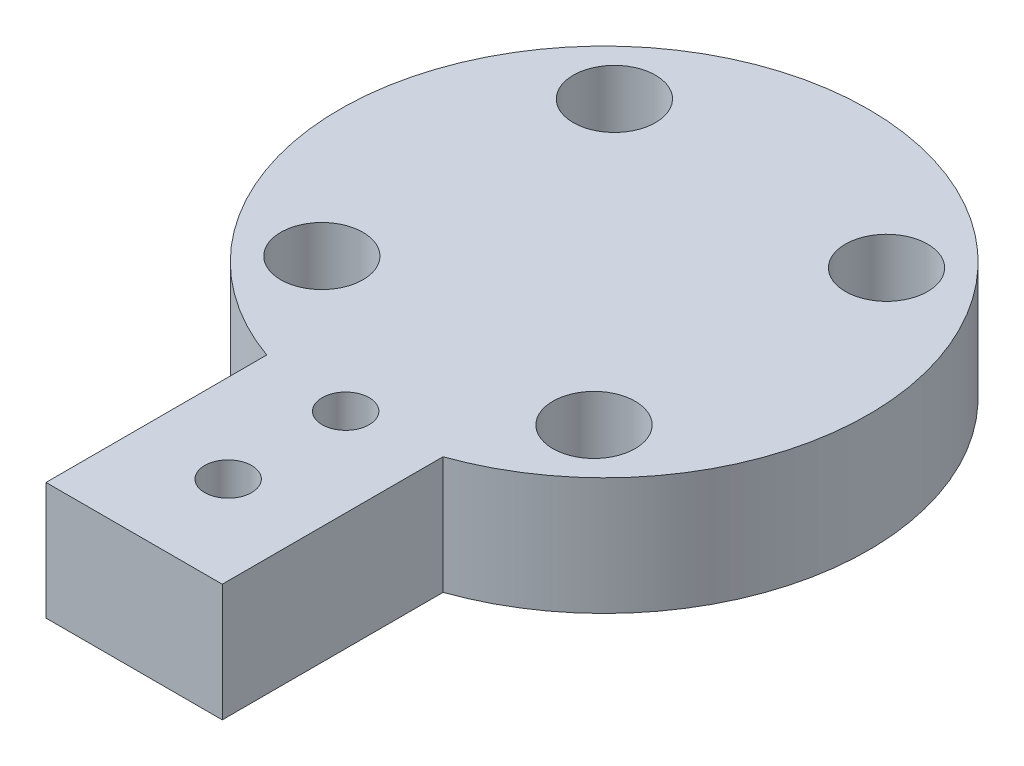
ISO-10303-21;
HEADER;
FILE_DESCRIPTION(('STEP AP214'),'2;1');
FILE_NAME('part.step','',(''),(''),'','','');
FILE_SCHEMA(('AUTOMOTIVE_DESIGN { 1 0 10303 214 1 1 1 1 }'));
ENDSEC;
DATA;
#1=APPLICATION_CONTEXT('core data for automotive mechanical design processes');
#2=APPLICATION_PROTOCOL_DEFINITION('international standard','automotive_design',2000,#1);
#3=PRODUCT_CONTEXT('',#1,'mechanical');
#4=PRODUCT('Part','Part','',(#3));
#5=PRODUCT_RELATED_PRODUCT_CATEGORY('part','',(#4));
#6=PRODUCT_DEFINITION_FORMATION('','',#4);
#7=PRODUCT_DEFINITION_CONTEXT('part definition',#1,'design');
#8=PRODUCT_DEFINITION('design','',#6,#7);
#9=PRODUCT_DEFINITION_SHAPE('','',#8);
#10=(LENGTH_UNIT() NAMED_UNIT(*) SI_UNIT(.MILLI.,.METRE.));
#11=(NAMED_UNIT(*) PLANE_ANGLE_UNIT() SI_UNIT($,.RADIAN.));
#12=(NAMED_UNIT(*) SI_UNIT($,.STERADIAN.) SOLID_ANGLE_UNIT());
#13=UNCERTAINTY_MEASURE_WITH_UNIT(LENGTH_MEASURE(1.E-05),#10,'distance_accuracy_value','');
#14=(GEOMETRIC_REPRESENTATION_CONTEXT(3) GLOBAL_UNCERTAINTY_ASSIGNED_CONTEXT((#13)) GLOBAL_UNIT_ASSIGNED_CONTEXT((#10,
#11,#12)) REPRESENTATION_CONTEXT('',''));
#15=CARTESIAN_POINT('',(0.,0.,0.));
#16=DIRECTION('',(0.,0.,1.));
#17=DIRECTION('',(1.,0.,0.));
#18=AXIS2_PLACEMENT_3D('',#15,#16,#17);
#19=CARTESIAN_POINT('',(-11.5793328179107,0.,-12.446648203113));
#20=DIRECTION('',(0.,1.,0.));
#21=DIRECTION('',(0.,0.,1.));
#22=AXIS2_PLACEMENT_3D('',#19,#20,#21);
#23=CYLINDRICAL_SURFACE('',#22,2.);
#24=CARTESIAN_POINT('',(-11.5793328179107,0.,-12.446648203113));
#25=DIRECTION('',(0.,1.,0.));
#26=DIRECTION('',(0.,0.,1.));
#27=AXIS2_PLACEMENT_3D('',#24,#25,#26);
#28=CIRCLE('',#27,2.);
#29=CARTESIAN_POINT('',(-11.5793328179107,0.,-10.446648203113));
#30=VERTEX_POINT('',#29);
#31=EDGE_CURVE('E118',#30,#30,#28,.T.);
#32=ORIENTED_EDGE('',*,*,#31,.F.);
#33=EDGE_LOOP('',(#32));
#34=FACE_BOUND('',#33,.T.);
#35=CARTESIAN_POINT('',(-11.5793328179107,5.,-12.446648203113));
#36=DIRECTION('',(0.,1.,0.));
#37=DIRECTION('',(0.,0.,1.));
#38=AXIS2_PLACEMENT_3D('',#35,#36,#37);
#39=CIRCLE('',#38,2.);
#40=CARTESIAN_POINT('',(-11.5793328179107,5.,-10.446648203113));
#41=VERTEX_POINT('',#40);
#42=EDGE_CURVE('E47',#41,#41,#39,.F.);
#43=ORIENTED_EDGE('',*,*,#42,.F.);
#44=EDGE_LOOP('',(#43));
#45=FACE_BOUND('',#44,.T.);
#46=ADVANCED_FACE('F43',(#34,#45),#23,.F.);
#47=CARTESIAN_POINT('',(12.4466482031131,0.,-11.5793328179113));
#48=DIRECTION('',(0.,1.,0.));
#49=DIRECTION('',(0.,0.,1.));
#50=AXIS2_PLACEMENT_3D('',#47,#48,#49);
#51=CYLINDRICAL_SURFACE('',#50,2.);
#52=CARTESIAN_POINT('',(12.4466482031131,0.,-11.5793328179113));
#53=DIRECTION('',(0.,1.,0.));
#54=DIRECTION('',(0.,0.,1.));
#55=AXIS2_PLACEMENT_3D('',#52,#53,#54);
#56=CIRCLE('',#55,2.);
#57=CARTESIAN_POINT('',(12.4466482031131,0.,-9.57933281791132));
#58=VERTEX_POINT('',#57);
#59=EDGE_CURVE('E162',#58,#58,#56,.T.);
#60=ORIENTED_EDGE('',*,*,#59,.F.);
#61=EDGE_LOOP('',(#60));
#62=FACE_BOUND('',#61,.T.);
#63=CARTESIAN_POINT('',(12.4466482031131,5.,-11.5793328179113));
#64=DIRECTION('',(0.,1.,0.));
#65=DIRECTION('',(0.,0.,1.));
#66=AXIS2_PLACEMENT_3D('',#63,#64,#65);
#67=CIRCLE('',#66,2.);
#68=CARTESIAN_POINT('',(12.4466482031131,5.,-9.57933281791132));
#69=VERTEX_POINT('',#68);
#70=EDGE_CURVE('E140',#69,#69,#67,.F.);
#71=ORIENTED_EDGE('',*,*,#70,.F.);
#72=EDGE_LOOP('',(#71));
#73=FACE_BOUND('',#72,.T.);
#74=ADVANCED_FACE('F249',(#62,#73),#51,.F.);
#75=CARTESIAN_POINT('',(11.5793328179113,0.,12.4466482031124));
#76=DIRECTION('',(0.,1.,0.));
#77=DIRECTION('',(0.,0.,1.));
#78=AXIS2_PLACEMENT_3D('',#75,#76,#77);
#79=CYLINDRICAL_SURFACE('',#78,2.);
#80=CARTESIAN_POINT('',(11.5793328179113,0.,12.4466482031124));
#81=DIRECTION('',(0.,1.,0.));
#82=DIRECTION('',(0.,0.,1.));
#83=AXIS2_PLACEMENT_3D('',#80,#81,#82);
#84=CIRCLE('',#83,2.);
#85=CARTESIAN_POINT('',(11.5793328179113,0.,14.4466482031124));
#86=VERTEX_POINT('',#85);
#87=EDGE_CURVE('E166',#86,#86,#84,.T.);
#88=ORIENTED_EDGE('',*,*,#87,.F.);
#89=EDGE_LOOP('',(#88));
#90=FACE_BOUND('',#89,.T.);
#91=CARTESIAN_POINT('',(11.5793328179113,5.,12.4466482031124));
#92=DIRECTION('',(0.,1.,0.));
#93=DIRECTION('',(0.,0.,1.));
#94=AXIS2_PLACEMENT_3D('',#91,#92,#93);
#95=CIRCLE('',#94,2.);
#96=CARTESIAN_POINT('',(11.5793328179113,5.,14.4466482031124));
#97=VERTEX_POINT('',#96);
#98=EDGE_CURVE('E136',#97,#97,#95,.F.);
#99=ORIENTED_EDGE('',*,*,#98,.F.);
#100=EDGE_LOOP('',(#99));
#101=FACE_BOUND('',#100,.T.);
#102=ADVANCED_FACE('F255',(#90,#101),#79,.F.);
#103=CARTESIAN_POINT('',(-12.4466482031124,0.,11.5793328179107));
#104=DIRECTION('',(0.,1.,0.));
#105=DIRECTION('',(0.,0.,1.));
#106=AXIS2_PLACEMENT_3D('',#103,#104,#105);
#107=CYLINDRICAL_SURFACE('',#106,2.);
#108=CARTESIAN_POINT('',(-12.4466482031124,0.,11.5793328179107));
#109=DIRECTION('',(0.,1.,0.));
#110=DIRECTION('',(0.,0.,1.));
#111=AXIS2_PLACEMENT_3D('',#108,#109,#110);
#112=CIRCLE('',#111,2.);
#113=CARTESIAN_POINT('',(-12.4466482031124,0.,13.5793328179107));
#114=VERTEX_POINT('',#113);
#115=EDGE_CURVE('E170',#114,#114,#112,.T.);
#116=ORIENTED_EDGE('',*,*,#115,.F.);
#117=EDGE_LOOP('',(#116));
#118=FACE_BOUND('',#117,.T.);
#119=CARTESIAN_POINT('',(-12.4466482031124,5.,11.5793328179107));
#120=DIRECTION('',(0.,1.,0.));
#121=DIRECTION('',(0.,0.,1.));
#122=AXIS2_PLACEMENT_3D('',#119,#120,#121);
#123=CIRCLE('',#122,2.);
#124=CARTESIAN_POINT('',(-12.4466482031124,5.,13.5793328179107));
#125=VERTEX_POINT('',#124);
#126=EDGE_CURVE('E132',#125,#125,#123,.F.);
#127=ORIENTED_EDGE('',*,*,#126,.F.);
#128=EDGE_LOOP('',(#127));
#129=FACE_BOUND('',#128,.T.);
#130=ADVANCED_FACE('F261',(#118,#129),#107,.F.);
#131=CARTESIAN_POINT('',(0.,10.,0.));
#132=DIRECTION('',(0.,-1.,0.));
#133=DIRECTION('',(0.,0.,-1.));
#134=AXIS2_PLACEMENT_3D('',#131,#132,#133);
#135=CYLINDRICAL_SURFACE('',#134,22.5);
#136=CARTESIAN_POINT('',(0.,0.,0.));
#137=DIRECTION('',(0.,1.,0.));
#138=DIRECTION('',(0.,0.,1.));
#139=AXIS2_PLACEMENT_3D('',#136,#137,#138);
#140=CIRCLE('',#139,22.5);
#141=CARTESIAN_POINT('',(7.5,0.,21.2132034355964));
#142=VERTEX_POINT('',#141);
#143=CARTESIAN_POINT('',(-7.5,0.,21.2132034355964));
#144=VERTEX_POINT('',#143);
#145=EDGE_CURVE('E115',#142,#144,#140,.T.);
#146=ORIENTED_EDGE('',*,*,#145,.T.);
#147=DIRECTION('',(0.,-1.,0.));
#148=VECTOR('',#147,1.);
#149=CARTESIAN_POINT('',(-7.5,10.,21.2132034355964));
#150=LINE('',#149,#148);
#151=CARTESIAN_POINT('',(-7.5,10.,21.2132034355964));
#152=VERTEX_POINT('',#151);
#153=EDGE_CURVE('E11',#152,#144,#150,.T.);
#154=ORIENTED_EDGE('',*,*,#153,.F.);
#155=CARTESIAN_POINT('',(0.,10.,0.));
#156=DIRECTION('',(0.,1.,0.));
#157=DIRECTION('',(0.,0.,1.));
#158=AXIS2_PLACEMENT_3D('',#155,#156,#157);
#159=CIRCLE('',#158,22.5);
#160=CARTESIAN_POINT('',(7.5,10.,21.2132034355964));
#161=VERTEX_POINT('',#160);
#162=EDGE_CURVE('E96',#161,#152,#159,.T.);
#163=ORIENTED_EDGE('',*,*,#162,.F.);
#164=DIRECTION('',(0.,-1.,0.));
#165=VECTOR('',#164,1.);
#166=CARTESIAN_POINT('',(7.5,10.,21.2132034355964));
#167=LINE('',#166,#165);
#168=EDGE_CURVE('E63',#161,#142,#167,.T.);
#169=ORIENTED_EDGE('',*,*,#168,.T.);
#170=EDGE_LOOP('',(#146,#154,#163,#169));
#171=FACE_BOUND('',#170,.T.);
#172=ADVANCED_FACE('F45',(#171),#135,.T.);
#173=CARTESIAN_POINT('',(-7.5,10.,0.));
#174=DIRECTION('',(1.,0.,0.));
#175=DIRECTION('',(0.,0.,-1.));
#176=AXIS2_PLACEMENT_3D('',#173,#174,#175);
#177=PLANE('',#176);
#178=DIRECTION('',(0.,0.,1.));
#179=VECTOR('',#178,1.);
#180=CARTESIAN_POINT('',(-7.5,0.,0.));
#181=LINE('',#180,#179);
#182=CARTESIAN_POINT('',(-7.5,0.,40.));
#183=VERTEX_POINT('',#182);
#184=EDGE_CURVE('E102',#144,#183,#181,.T.);
#185=ORIENTED_EDGE('',*,*,#184,.T.);
#186=DIRECTION('',(0.,-1.,0.));
#187=VECTOR('',#186,1.);
#188=CARTESIAN_POINT('',(-7.5,10.,40.));
#189=LINE('',#188,#187);
#190=CARTESIAN_POINT('',(-7.5,10.,40.));
#191=VERTEX_POINT('',#190);
#192=EDGE_CURVE('E54',#191,#183,#189,.T.);
#193=ORIENTED_EDGE('',*,*,#192,.F.);
#194=DIRECTION('',(0.,0.,1.));
#195=VECTOR('',#194,1.);
#196=CARTESIAN_POINT('',(-7.5,10.,0.));
#197=LINE('',#196,#195);
#198=EDGE_CURVE('E89',#152,#191,#197,.T.);
#199=ORIENTED_EDGE('',*,*,#198,.F.);
#200=ORIENTED_EDGE('',*,*,#153,.T.);
#201=EDGE_LOOP('',(#185,#193,#199,#200));
#202=FACE_BOUND('',#201,.T.);
#203=ADVANCED_FACE('F101',(#202),#177,.F.);
#204=CARTESIAN_POINT('',(0.,10.,40.));
#205=DIRECTION('',(0.,0.,-1.));
#206=DIRECTION('',(-1.,0.,0.));
#207=AXIS2_PLACEMENT_3D('',#204,#205,#206);
#208=PLANE('',#207);
#209=DIRECTION('',(1.,0.,0.));
#210=VECTOR('',#209,1.);
#211=CARTESIAN_POINT('',(0.,0.,40.));
#212=LINE('',#211,#210);
#213=CARTESIAN_POINT('',(7.5,0.,40.));
#214=VERTEX_POINT('',#213);
#215=EDGE_CURVE('E121',#183,#214,#212,.T.);
#216=ORIENTED_EDGE('',*,*,#215,.T.);
#217=DIRECTION('',(0.,-1.,0.));
#218=VECTOR('',#217,1.);
#219=CARTESIAN_POINT('',(7.5,10.,40.));
#220=LINE('',#219,#218);
#221=CARTESIAN_POINT('',(7.5,10.,40.));
#222=VERTEX_POINT('',#221);
#223=EDGE_CURVE('E78',#222,#214,#220,.T.);
#224=ORIENTED_EDGE('',*,*,#223,.F.);
#225=DIRECTION('',(1.,0.,0.));
#226=VECTOR('',#225,1.);
#227=CARTESIAN_POINT('',(0.,10.,40.));
#228=LINE('',#227,#226);
#229=EDGE_CURVE('E95',#191,#222,#228,.T.);
#230=ORIENTED_EDGE('',*,*,#229,.F.);
#231=ORIENTED_EDGE('',*,*,#192,.T.);
#232=EDGE_LOOP('',(#216,#224,#230,#231));
#233=FACE_BOUND('',#232,.T.);
#234=ADVANCED_FACE('F107',(#233),#208,.F.);
#235=CARTESIAN_POINT('',(7.5,10.,0.));
#236=DIRECTION('',(1.,0.,0.));
#237=DIRECTION('',(0.,0.,-1.));
#238=AXIS2_PLACEMENT_3D('',#235,#236,#237);
#239=PLANE('',#238);
#240=DIRECTION('',(0.,0.,1.));
#241=VECTOR('',#240,1.);
#242=CARTESIAN_POINT('',(7.5,0.,0.));
#243=LINE('',#242,#241);
#244=EDGE_CURVE('E124',#142,#214,#243,.T.);
#245=ORIENTED_EDGE('',*,*,#244,.F.);
#246=ORIENTED_EDGE('',*,*,#168,.F.);
#247=DIRECTION('',(0.,0.,1.));
#248=VECTOR('',#247,1.);
#249=CARTESIAN_POINT('',(7.5,10.,0.));
#250=LINE('',#249,#248);
#251=EDGE_CURVE('E109',#161,#222,#250,.T.);
#252=ORIENTED_EDGE('',*,*,#251,.T.);
#253=ORIENTED_EDGE('',*,*,#223,.T.);
#254=EDGE_LOOP('',(#245,#246,#252,#253));
#255=FACE_BOUND('',#254,.T.);
#256=ADVANCED_FACE('F230',(#255),#239,.T.);
#257=CARTESIAN_POINT('',(0.,10.,0.));
#258=DIRECTION('',(0.,1.,0.));
#259=DIRECTION('',(0.,0.,1.));
#260=AXIS2_PLACEMENT_3D('',#257,#258,#259);
#261=PLANE('',#260);
#262=CARTESIAN_POINT('',(-12.4466482031124,10.,11.5793328179107));
#263=DIRECTION('',(0.,1.,0.));
#264=DIRECTION('',(0.,0.,1.));
#265=AXIS2_PLACEMENT_3D('',#262,#263,#264);
#266=CIRCLE('',#265,3.5);
#267=CARTESIAN_POINT('',(-12.4466482031124,10.,15.0793328179107));
#268=VERTEX_POINT('',#267);
#269=EDGE_CURVE('E194',#268,#268,#266,.T.);
#270=ORIENTED_EDGE('',*,*,#269,.F.);
#271=EDGE_LOOP('',(#270));
#272=FACE_BOUND('',#271,.T.);
#273=CARTESIAN_POINT('',(11.5793328179113,10.,12.4466482031124));
#274=DIRECTION('',(0.,1.,0.));
#275=DIRECTION('',(0.,0.,1.));
#276=AXIS2_PLACEMENT_3D('',#273,#274,#275);
#277=CIRCLE('',#276,3.5);
#278=CARTESIAN_POINT('',(11.5793328179113,10.,15.9466482031124));
#279=VERTEX_POINT('',#278);
#280=EDGE_CURVE('E202',#279,#279,#277,.T.);
#281=ORIENTED_EDGE('',*,*,#280,.F.);
#282=EDGE_LOOP('',(#281));
#283=FACE_BOUND('',#282,.T.);
#284=CARTESIAN_POINT('',(12.4466482031131,10.,-11.5793328179113));
#285=DIRECTION('',(0.,1.,0.));
#286=DIRECTION('',(0.,0.,1.));
#287=AXIS2_PLACEMENT_3D('',#284,#285,#286);
#288=CIRCLE('',#287,3.5);
#289=CARTESIAN_POINT('',(12.4466482031131,10.,-8.07933281791132));
#290=VERTEX_POINT('',#289);
#291=EDGE_CURVE('E210',#290,#290,#288,.T.);
#292=ORIENTED_EDGE('',*,*,#291,.F.);
#293=EDGE_LOOP('',(#292));
#294=FACE_BOUND('',#293,.T.);
#295=CARTESIAN_POINT('',(-11.5793328179107,10.,-12.446648203113));
#296=DIRECTION('',(0.,1.,0.));
#297=DIRECTION('',(0.,0.,1.));
#298=AXIS2_PLACEMENT_3D('',#295,#296,#297);
#299=CIRCLE('',#298,3.5);
#300=CARTESIAN_POINT('',(-11.5793328179107,10.,-8.94664820311304));
#301=VERTEX_POINT('',#300);
#302=EDGE_CURVE('E186',#301,#301,#299,.T.);
#303=ORIENTED_EDGE('',*,*,#302,.F.);
#304=EDGE_LOOP('',(#303));
#305=FACE_BOUND('',#304,.T.);
#306=CARTESIAN_POINT('',(0.,10.,22.));
#307=DIRECTION('',(0.,1.,0.));
#308=DIRECTION('',(0.,0.,1.));
#309=AXIS2_PLACEMENT_3D('',#306,#307,#308);
#310=CIRCLE('',#309,2.);
#311=CARTESIAN_POINT('',(0.,10.,24.));
#312=VERTEX_POINT('',#311);
#313=EDGE_CURVE('E158',#312,#312,#310,.T.);
#314=ORIENTED_EDGE('',*,*,#313,.F.);
#315=EDGE_LOOP('',(#314));
#316=FACE_BOUND('',#315,.T.);
#317=CARTESIAN_POINT('',(0.,10.,32.));
#318=DIRECTION('',(0.,1.,0.));
#319=DIRECTION('',(0.,0.,1.));
#320=AXIS2_PLACEMENT_3D('',#317,#318,#319);
#321=CIRCLE('',#320,2.);
#322=CARTESIAN_POINT('',(0.,10.,34.));
#323=VERTEX_POINT('',#322);
#324=EDGE_CURVE('E147',#323,#323,#321,.T.);
#325=ORIENTED_EDGE('',*,*,#324,.F.);
#326=EDGE_LOOP('',(#325));
#327=FACE_BOUND('',#326,.T.);
#328=ORIENTED_EDGE('',*,*,#162,.T.);
#329=ORIENTED_EDGE('',*,*,#198,.T.);
#330=ORIENTED_EDGE('',*,*,#229,.T.);
#331=ORIENTED_EDGE('',*,*,#251,.F.);
#332=EDGE_LOOP('',(#328,#329,#330,#331));
#333=FACE_BOUND('',#332,.T.);
#334=ADVANCED_FACE('F92',(#272,#283,#294,#305,#316,#327,#333),#261,.T.);
#335=CARTESIAN_POINT('',(0.,0.,0.));
#336=DIRECTION('',(0.,1.,0.));
#337=DIRECTION('',(0.,0.,1.));
#338=AXIS2_PLACEMENT_3D('',#335,#336,#337);
#339=PLANE('',#338);
#340=CARTESIAN_POINT('',(0.,0.,22.));
#341=DIRECTION('',(0.,1.,0.));
#342=DIRECTION('',(0.,0.,1.));
#343=AXIS2_PLACEMENT_3D('',#340,#341,#342);
#344=CIRCLE('',#343,2.);
#345=CARTESIAN_POINT('',(0.,0.,24.));
#346=VERTEX_POINT('',#345);
#347=EDGE_CURVE('E174',#346,#346,#344,.T.);
#348=ORIENTED_EDGE('',*,*,#347,.T.);
#349=EDGE_LOOP('',(#348));
#350=FACE_BOUND('',#349,.T.);
#351=CARTESIAN_POINT('',(0.,0.,32.));
#352=DIRECTION('',(0.,1.,0.));
#353=DIRECTION('',(0.,0.,1.));
#354=AXIS2_PLACEMENT_3D('',#351,#352,#353);
#355=CIRCLE('',#354,2.);
#356=CARTESIAN_POINT('',(0.,0.,34.));
#357=VERTEX_POINT('',#356);
#358=EDGE_CURVE('E152',#357,#357,#355,.T.);
#359=ORIENTED_EDGE('',*,*,#358,.T.);
#360=EDGE_LOOP('',(#359));
#361=FACE_BOUND('',#360,.T.);
#362=ORIENTED_EDGE('',*,*,#115,.T.);
#363=EDGE_LOOP('',(#362));
#364=FACE_BOUND('',#363,.T.);
#365=ORIENTED_EDGE('',*,*,#87,.T.);
#366=EDGE_LOOP('',(#365));
#367=FACE_BOUND('',#366,.T.);
#368=ORIENTED_EDGE('',*,*,#59,.T.);
#369=EDGE_LOOP('',(#368));
#370=FACE_BOUND('',#369,.T.);
#371=ORIENTED_EDGE('',*,*,#31,.T.);
#372=EDGE_LOOP('',(#371));
#373=FACE_BOUND('',#372,.T.);
#374=ORIENTED_EDGE('',*,*,#145,.F.);
#375=ORIENTED_EDGE('',*,*,#244,.T.);
#376=ORIENTED_EDGE('',*,*,#215,.F.);
#377=ORIENTED_EDGE('',*,*,#184,.F.);
#378=EDGE_LOOP('',(#374,#375,#376,#377));
#379=FACE_BOUND('',#378,.T.);
#380=ADVANCED_FACE('F229',(#350,#361,#364,#367,#370,#373,#379),#339,.F.);
#381=CARTESIAN_POINT('',(0.,0.,32.));
#382=DIRECTION('',(0.,1.,0.));
#383=DIRECTION('',(0.,0.,1.));
#384=AXIS2_PLACEMENT_3D('',#381,#382,#383);
#385=CYLINDRICAL_SURFACE('',#384,2.);
#386=ORIENTED_EDGE('',*,*,#358,.F.);
#387=EDGE_LOOP('',(#386));
#388=FACE_BOUND('',#387,.T.);
#389=ORIENTED_EDGE('',*,*,#324,.T.);
#390=EDGE_LOOP('',(#389));
#391=FACE_BOUND('',#390,.T.);
#392=ADVANCED_FACE('F266',(#388,#391),#385,.F.);
#393=CARTESIAN_POINT('',(0.,0.,22.));
#394=DIRECTION('',(0.,1.,0.));
#395=DIRECTION('',(0.,0.,1.));
#396=AXIS2_PLACEMENT_3D('',#393,#394,#395);
#397=CYLINDRICAL_SURFACE('',#396,2.);
#398=ORIENTED_EDGE('',*,*,#347,.F.);
#399=EDGE_LOOP('',(#398));
#400=FACE_BOUND('',#399,.T.);
#401=ORIENTED_EDGE('',*,*,#313,.T.);
#402=EDGE_LOOP('',(#401));
#403=FACE_BOUND('',#402,.T.);
#404=ADVANCED_FACE('F291',(#400,#403),#397,.F.);
#405=CARTESIAN_POINT('',(-12.4466482031124,5.,11.5793328179107));
#406=DIRECTION('',(0.,1.,0.));
#407=DIRECTION('',(0.,0.,1.));
#408=AXIS2_PLACEMENT_3D('',#405,#406,#407);
#409=PLANE('',#408);
#410=CARTESIAN_POINT('',(-12.4466482031124,5.,11.5793328179107));
#411=DIRECTION('',(0.,1.,0.));
#412=DIRECTION('',(0.,0.,1.));
#413=AXIS2_PLACEMENT_3D('',#410,#411,#412);
#414=CIRCLE('',#413,3.5);
#415=CARTESIAN_POINT('',(-12.4466482031124,5.,15.0793328179107));
#416=VERTEX_POINT('',#415);
#417=EDGE_CURVE('E198',#416,#416,#414,.T.);
#418=ORIENTED_EDGE('',*,*,#417,.T.);
#419=EDGE_LOOP('',(#418));
#420=FACE_BOUND('',#419,.T.);
#421=ORIENTED_EDGE('',*,*,#126,.T.);
#422=EDGE_LOOP('',(#421));
#423=FACE_BOUND('',#422,.T.);
#424=ADVANCED_FACE('F288',(#420,#423),#409,.T.);
#425=CARTESIAN_POINT('',(-12.4466482031124,5.,11.5793328179107));
#426=DIRECTION('',(0.,1.,0.));
#427=DIRECTION('',(0.,0.,1.));
#428=AXIS2_PLACEMENT_3D('',#425,#426,#427);
#429=CYLINDRICAL_SURFACE('',#428,3.5);
#430=ORIENTED_EDGE('',*,*,#417,.F.);
#431=EDGE_LOOP('',(#430));
#432=FACE_BOUND('',#431,.T.);
#433=ORIENTED_EDGE('',*,*,#269,.T.);
#434=EDGE_LOOP('',(#433));
#435=FACE_BOUND('',#434,.T.);
#436=ADVANCED_FACE('F290',(#432,#435),#429,.F.);
#437=CARTESIAN_POINT('',(11.5793328179113,5.,12.4466482031124));
#438=DIRECTION('',(0.,1.,0.));
#439=DIRECTION('',(0.,0.,1.));
#440=AXIS2_PLACEMENT_3D('',#437,#438,#439);
#441=PLANE('',#440);
#442=CARTESIAN_POINT('',(11.5793328179113,5.,12.4466482031124));
#443=DIRECTION('',(0.,1.,0.));
#444=DIRECTION('',(0.,0.,1.));
#445=AXIS2_PLACEMENT_3D('',#442,#443,#444);
#446=CIRCLE('',#445,3.5);
#447=CARTESIAN_POINT('',(11.5793328179113,5.,15.9466482031124));
#448=VERTEX_POINT('',#447);
#449=EDGE_CURVE('E206',#448,#448,#446,.T.);
#450=ORIENTED_EDGE('',*,*,#449,.T.);
#451=EDGE_LOOP('',(#450));
#452=FACE_BOUND('',#451,.T.);
#453=ORIENTED_EDGE('',*,*,#98,.T.);
#454=EDGE_LOOP('',(#453));
#455=FACE_BOUND('',#454,.T.);
#456=ADVANCED_FACE('F298',(#452,#455),#441,.T.);
#457=CARTESIAN_POINT('',(11.5793328179113,5.,12.4466482031124));
#458=DIRECTION('',(0.,1.,0.));
#459=DIRECTION('',(0.,0.,1.));
#460=AXIS2_PLACEMENT_3D('',#457,#458,#459);
#461=CYLINDRICAL_SURFACE('',#460,3.5);
#462=ORIENTED_EDGE('',*,*,#449,.F.);
#463=EDGE_LOOP('',(#462));
#464=FACE_BOUND('',#463,.T.);
#465=ORIENTED_EDGE('',*,*,#280,.T.);
#466=EDGE_LOOP('',(#465));
#467=FACE_BOUND('',#466,.T.);
#468=ADVANCED_FACE('F303',(#464,#467),#461,.F.);
#469=CARTESIAN_POINT('',(12.4466482031131,5.,-11.5793328179113));
#470=DIRECTION('',(0.,1.,0.));
#471=DIRECTION('',(0.,0.,1.));
#472=AXIS2_PLACEMENT_3D('',#469,#470,#471);
#473=PLANE('',#472);
#474=CARTESIAN_POINT('',(12.4466482031131,5.,-11.5793328179113));
#475=DIRECTION('',(0.,1.,0.));
#476=DIRECTION('',(0.,0.,1.));
#477=AXIS2_PLACEMENT_3D('',#474,#475,#476);
#478=CIRCLE('',#477,3.5);
#479=CARTESIAN_POINT('',(12.4466482031131,5.,-8.07933281791132));
#480=VERTEX_POINT('',#479);
#481=EDGE_CURVE('E190',#480,#480,#478,.T.);
#482=ORIENTED_EDGE('',*,*,#481,.T.);
#483=EDGE_LOOP('',(#482));
#484=FACE_BOUND('',#483,.T.);
#485=ORIENTED_EDGE('',*,*,#70,.T.);
#486=EDGE_LOOP('',(#485));
#487=FACE_BOUND('',#486,.T.);
#488=ADVANCED_FACE('F218',(#484,#487),#473,.T.);
#489=CARTESIAN_POINT('',(12.4466482031131,5.,-11.5793328179113));
#490=DIRECTION('',(0.,1.,0.));
#491=DIRECTION('',(0.,0.,1.));
#492=AXIS2_PLACEMENT_3D('',#489,#490,#491);
#493=CYLINDRICAL_SURFACE('',#492,3.5);
#494=ORIENTED_EDGE('',*,*,#481,.F.);
#495=EDGE_LOOP('',(#494));
#496=FACE_BOUND('',#495,.T.);
#497=ORIENTED_EDGE('',*,*,#291,.T.);
#498=EDGE_LOOP('',(#497));
#499=FACE_BOUND('',#498,.T.);
#500=ADVANCED_FACE('F220',(#496,#499),#493,.F.);
#501=CARTESIAN_POINT('',(-11.5793328179107,5.,-12.446648203113));
#502=DIRECTION('',(0.,1.,0.));
#503=DIRECTION('',(0.,0.,1.));
#504=AXIS2_PLACEMENT_3D('',#501,#502,#503);
#505=PLANE('',#504);
#506=CARTESIAN_POINT('',(-11.5793328179107,5.,-12.446648203113));
#507=DIRECTION('',(0.,1.,0.));
#508=DIRECTION('',(0.,0.,1.));
#509=AXIS2_PLACEMENT_3D('',#506,#507,#508);
#510=CIRCLE('',#509,3.5);
#511=CARTESIAN_POINT('',(-11.5793328179107,5.,-8.94664820311304));
#512=VERTEX_POINT('',#511);
#513=EDGE_CURVE('E137',#512,#512,#510,.T.);
#514=ORIENTED_EDGE('',*,*,#513,.T.);
#515=EDGE_LOOP('',(#514));
#516=FACE_BOUND('',#515,.T.);
#517=ORIENTED_EDGE('',*,*,#42,.T.);
#518=EDGE_LOOP('',(#517));
#519=FACE_BOUND('',#518,.T.);
#520=ADVANCED_FACE('F223',(#516,#519),#505,.T.);
#521=CARTESIAN_POINT('',(-11.5793328179107,5.,-12.446648203113));
#522=DIRECTION('',(0.,1.,0.));
#523=DIRECTION('',(0.,0.,1.));
#524=AXIS2_PLACEMENT_3D('',#521,#522,#523);
#525=CYLINDRICAL_SURFACE('',#524,3.5);
#526=ORIENTED_EDGE('',*,*,#513,.F.);
#527=EDGE_LOOP('',(#526));
#528=FACE_BOUND('',#527,.T.);
#529=ORIENTED_EDGE('',*,*,#302,.T.);
#530=EDGE_LOOP('',(#529));
#531=FACE_BOUND('',#530,.T.);
#532=ADVANCED_FACE('F237',(#528,#531),#525,.F.);
#533=CLOSED_SHELL('',(#46,#74,#102,#130,#172,#203,#234,#256,#334,#380,#392,#404,#424,#436,#456,
#468,#488,#500,#520,#532));
#534=MANIFOLD_SOLID_BREP('B2',#533);
#535=ADVANCED_BREP_SHAPE_REPRESENTATION('',(#18,#534),#14);
#536=SHAPE_DEFINITION_REPRESENTATION(#9,#535);
ENDSEC;
END-ISO-10303-21;
